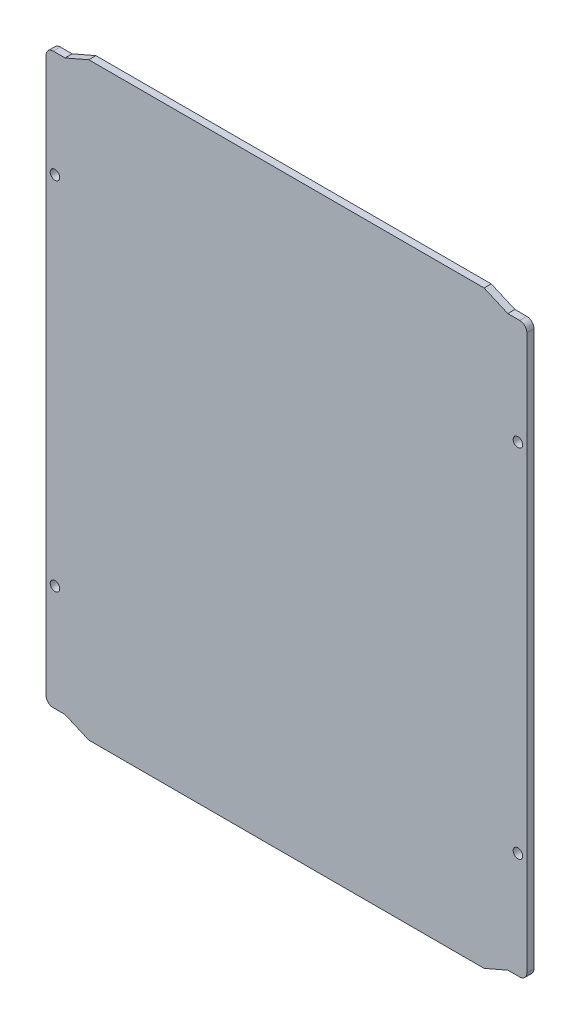
ISO-10303-21;
HEADER;
FILE_DESCRIPTION(('STEP AP214'),'2;1');
FILE_NAME('part.step','',(''),(''),'','','');
FILE_SCHEMA(('AUTOMOTIVE_DESIGN { 1 0 10303 214 1 1 1 1 }'));
ENDSEC;
DATA;
#1=APPLICATION_CONTEXT('core data for automotive mechanical design processes');
#2=APPLICATION_PROTOCOL_DEFINITION('international standard','automotive_design',2000,#1);
#3=PRODUCT_CONTEXT('',#1,'mechanical');
#4=PRODUCT('Part','Part','',(#3));
#5=PRODUCT_RELATED_PRODUCT_CATEGORY('part','',(#4));
#6=PRODUCT_DEFINITION_FORMATION('','',#4);
#7=PRODUCT_DEFINITION_CONTEXT('part definition',#1,'design');
#8=PRODUCT_DEFINITION('design','',#6,#7);
#9=PRODUCT_DEFINITION_SHAPE('','',#8);
#10=(LENGTH_UNIT() NAMED_UNIT(*) SI_UNIT(.MILLI.,.METRE.));
#11=(NAMED_UNIT(*) PLANE_ANGLE_UNIT() SI_UNIT($,.RADIAN.));
#12=(NAMED_UNIT(*) SI_UNIT($,.STERADIAN.) SOLID_ANGLE_UNIT());
#13=UNCERTAINTY_MEASURE_WITH_UNIT(LENGTH_MEASURE(1.E-05),#10,'distance_accuracy_value','');
#14=(GEOMETRIC_REPRESENTATION_CONTEXT(3) GLOBAL_UNCERTAINTY_ASSIGNED_CONTEXT((#13)) GLOBAL_UNIT_ASSIGNED_CONTEXT((#10,
#11,#12)) REPRESENTATION_CONTEXT('',''));
#15=CARTESIAN_POINT('',(0.,0.,0.));
#16=DIRECTION('',(0.,0.,1.));
#17=DIRECTION('',(1.,0.,0.));
#18=AXIS2_PLACEMENT_3D('',#15,#16,#17);
#19=CARTESIAN_POINT('',(3.,7.34000000000001,3.));
#20=DIRECTION('',(0.,0.,-1.));
#21=DIRECTION('',(-1.,0.,0.));
#22=AXIS2_PLACEMENT_3D('',#19,#20,#21);
#23=CYLINDRICAL_SURFACE('',#22,3.);
#24=CARTESIAN_POINT('',(3.,7.34000000000001,0.));
#25=DIRECTION('',(0.,0.,1.));
#26=DIRECTION('',(-1.,0.,0.));
#27=AXIS2_PLACEMENT_3D('',#24,#25,#26);
#28=CIRCLE('',#27,3.);
#29=CARTESIAN_POINT('',(0.,7.34000000000001,0.));
#30=VERTEX_POINT('',#29);
#31=CARTESIAN_POINT('',(3.,4.34000000000001,0.));
#32=VERTEX_POINT('',#31);
#33=EDGE_CURVE('E183',#30,#32,#28,.T.);
#34=ORIENTED_EDGE('',*,*,#33,.T.);
#35=DIRECTION('',(0.,0.,-1.));
#36=VECTOR('',#35,1.);
#37=CARTESIAN_POINT('',(3.,4.34000000000001,3.));
#38=LINE('',#37,#36);
#39=CARTESIAN_POINT('',(3.,4.34000000000001,3.));
#40=VERTEX_POINT('',#39);
#41=EDGE_CURVE('E12',#40,#32,#38,.T.);
#42=ORIENTED_EDGE('',*,*,#41,.F.);
#43=CARTESIAN_POINT('',(3.,7.34000000000001,3.));
#44=DIRECTION('',(0.,0.,1.));
#45=DIRECTION('',(-1.,0.,0.));
#46=AXIS2_PLACEMENT_3D('',#43,#44,#45);
#47=CIRCLE('',#46,3.);
#48=CARTESIAN_POINT('',(0.,7.34000000000001,3.));
#49=VERTEX_POINT('',#48);
#50=EDGE_CURVE('E201',#49,#40,#47,.T.);
#51=ORIENTED_EDGE('',*,*,#50,.F.);
#52=DIRECTION('',(0.,0.,-1.));
#53=VECTOR('',#52,1.);
#54=CARTESIAN_POINT('',(0.,7.34000000000001,3.));
#55=LINE('',#54,#53);
#56=EDGE_CURVE('E179',#49,#30,#55,.T.);
#57=ORIENTED_EDGE('',*,*,#56,.T.);
#58=EDGE_LOOP('',(#34,#42,#51,#57));
#59=FACE_BOUND('',#58,.T.);
#60=ADVANCED_FACE('F39',(#59),#23,.T.);
#61=CARTESIAN_POINT('',(8.,4.34000000000001,3.));
#62=DIRECTION('',(0.,1.,0.));
#63=DIRECTION('',(0.,0.,1.));
#64=AXIS2_PLACEMENT_3D('',#61,#62,#63);
#65=PLANE('',#64);
#66=DIRECTION('',(1.,0.,0.));
#67=VECTOR('',#66,1.);
#68=CARTESIAN_POINT('',(8.,4.34000000000001,0.));
#69=LINE('',#68,#67);
#70=CARTESIAN_POINT('',(8.,4.34000000000001,0.));
#71=VERTEX_POINT('',#70);
#72=EDGE_CURVE('E186',#32,#71,#69,.T.);
#73=ORIENTED_EDGE('',*,*,#72,.T.);
#74=DIRECTION('',(0.,0.,-1.));
#75=VECTOR('',#74,1.);
#76=CARTESIAN_POINT('',(8.,4.34000000000001,3.));
#77=LINE('',#76,#75);
#78=CARTESIAN_POINT('',(8.,4.34000000000001,3.));
#79=VERTEX_POINT('',#78);
#80=EDGE_CURVE('E47',#79,#71,#77,.T.);
#81=ORIENTED_EDGE('',*,*,#80,.F.);
#82=DIRECTION('',(1.,0.,0.));
#83=VECTOR('',#82,1.);
#84=CARTESIAN_POINT('',(8.,4.34000000000001,3.));
#85=LINE('',#84,#83);
#86=EDGE_CURVE('E122',#40,#79,#85,.T.);
#87=ORIENTED_EDGE('',*,*,#86,.F.);
#88=ORIENTED_EDGE('',*,*,#41,.T.);
#89=EDGE_LOOP('',(#73,#81,#87,#88));
#90=FACE_BOUND('',#89,.T.);
#91=ADVANCED_FACE('F316',(#90),#65,.F.);
#92=CARTESIAN_POINT('',(18.,0.,3.));
#93=DIRECTION('',(0.398122248208909,0.917332369144948,0.));
#94=DIRECTION('',(-0.917332369144949,0.398122248208909,0.));
#95=AXIS2_PLACEMENT_3D('',#92,#93,#94);
#96=PLANE('',#95);
#97=DIRECTION('',(0.917332369144949,-0.398122248208909,0.));
#98=VECTOR('',#97,1.);
#99=CARTESIAN_POINT('',(18.,0.,0.));
#100=LINE('',#99,#98);
#101=CARTESIAN_POINT('',(18.,0.,0.));
#102=VERTEX_POINT('',#101);
#103=EDGE_CURVE('E242',#71,#102,#100,.T.);
#104=ORIENTED_EDGE('',*,*,#103,.T.);
#105=DIRECTION('',(0.,0.,-1.));
#106=VECTOR('',#105,1.);
#107=CARTESIAN_POINT('',(18.,0.,3.));
#108=LINE('',#107,#106);
#109=CARTESIAN_POINT('',(18.,0.,3.));
#110=VERTEX_POINT('',#109);
#111=EDGE_CURVE('E234',#110,#102,#108,.T.);
#112=ORIENTED_EDGE('',*,*,#111,.F.);
#113=DIRECTION('',(0.917332369144949,-0.398122248208909,0.));
#114=VECTOR('',#113,1.);
#115=CARTESIAN_POINT('',(18.,0.,3.));
#116=LINE('',#115,#114);
#117=EDGE_CURVE('E243',#79,#110,#116,.T.);
#118=ORIENTED_EDGE('',*,*,#117,.F.);
#119=ORIENTED_EDGE('',*,*,#80,.T.);
#120=EDGE_LOOP('',(#104,#112,#118,#119));
#121=FACE_BOUND('',#120,.T.);
#122=ADVANCED_FACE('F240',(#121),#96,.F.);
#123=CARTESIAN_POINT('',(184.5,0.,3.));
#124=DIRECTION('',(0.,1.,0.));
#125=DIRECTION('',(-1.,0.,0.));
#126=AXIS2_PLACEMENT_3D('',#123,#124,#125);
#127=PLANE('',#126);
#128=DIRECTION('',(1.,0.,0.));
#129=VECTOR('',#128,1.);
#130=CARTESIAN_POINT('',(184.5,0.,0.));
#131=LINE('',#130,#129);
#132=CARTESIAN_POINT('',(184.5,0.,0.));
#133=VERTEX_POINT('',#132);
#134=EDGE_CURVE('E249',#102,#133,#131,.T.);
#135=ORIENTED_EDGE('',*,*,#134,.T.);
#136=DIRECTION('',(0.,0.,-1.));
#137=VECTOR('',#136,1.);
#138=CARTESIAN_POINT('',(184.5,0.,3.));
#139=LINE('',#138,#137);
#140=CARTESIAN_POINT('',(184.5,0.,3.));
#141=VERTEX_POINT('',#140);
#142=EDGE_CURVE('E231',#141,#133,#139,.T.);
#143=ORIENTED_EDGE('',*,*,#142,.F.);
#144=DIRECTION('',(1.,0.,0.));
#145=VECTOR('',#144,1.);
#146=CARTESIAN_POINT('',(184.5,0.,3.));
#147=LINE('',#146,#145);
#148=EDGE_CURVE('E584',#110,#141,#147,.T.);
#149=ORIENTED_EDGE('',*,*,#148,.F.);
#150=ORIENTED_EDGE('',*,*,#111,.T.);
#151=EDGE_LOOP('',(#135,#143,#149,#150));
#152=FACE_BOUND('',#151,.T.);
#153=ADVANCED_FACE('F323',(#152),#127,.F.);
#154=CARTESIAN_POINT('',(194.5,4.34000000000018,3.));
#155=DIRECTION('',(-0.398122248208922,0.917332369144943,0.));
#156=DIRECTION('',(-0.917332369144943,-0.398122248208922,0.));
#157=AXIS2_PLACEMENT_3D('',#154,#155,#156);
#158=PLANE('',#157);
#159=DIRECTION('',(0.917332369144943,0.398122248208922,0.));
#160=VECTOR('',#159,1.);
#161=CARTESIAN_POINT('',(194.5,4.34000000000018,0.));
#162=LINE('',#161,#160);
#163=CARTESIAN_POINT('',(194.5,4.34000000000018,0.));
#164=VERTEX_POINT('',#163);
#165=EDGE_CURVE('E250',#133,#164,#162,.T.);
#166=ORIENTED_EDGE('',*,*,#165,.T.);
#167=DIRECTION('',(0.,0.,-1.));
#168=VECTOR('',#167,1.);
#169=CARTESIAN_POINT('',(194.5,4.34000000000018,3.));
#170=LINE('',#169,#168);
#171=CARTESIAN_POINT('',(194.5,4.34000000000018,3.));
#172=VERTEX_POINT('',#171);
#173=EDGE_CURVE('E228',#172,#164,#170,.T.);
#174=ORIENTED_EDGE('',*,*,#173,.F.);
#175=DIRECTION('',(0.917332369144943,0.398122248208922,0.));
#176=VECTOR('',#175,1.);
#177=CARTESIAN_POINT('',(194.5,4.34000000000018,3.));
#178=LINE('',#177,#176);
#179=EDGE_CURVE('E586',#141,#172,#178,.T.);
#180=ORIENTED_EDGE('',*,*,#179,.F.);
#181=ORIENTED_EDGE('',*,*,#142,.T.);
#182=EDGE_LOOP('',(#166,#174,#180,#181));
#183=FACE_BOUND('',#182,.T.);
#184=ADVANCED_FACE('F328',(#183),#158,.F.);
#185=CARTESIAN_POINT('',(199.5,4.3400000000001,3.));
#186=DIRECTION('',(0.,1.,0.));
#187=DIRECTION('',(-1.,0.,0.));
#188=AXIS2_PLACEMENT_3D('',#185,#186,#187);
#189=PLANE('',#188);
#190=DIRECTION('',(1.,0.,0.));
#191=VECTOR('',#190,1.);
#192=CARTESIAN_POINT('',(199.5,4.3400000000001,0.));
#193=LINE('',#192,#191);
#194=CARTESIAN_POINT('',(199.5,4.3400000000001,0.));
#195=VERTEX_POINT('',#194);
#196=EDGE_CURVE('E261',#164,#195,#193,.T.);
#197=ORIENTED_EDGE('',*,*,#196,.T.);
#198=DIRECTION('',(0.,0.,-1.));
#199=VECTOR('',#198,1.);
#200=CARTESIAN_POINT('',(199.5,4.3400000000001,3.));
#201=LINE('',#200,#199);
#202=CARTESIAN_POINT('',(199.5,4.3400000000001,3.));
#203=VERTEX_POINT('',#202);
#204=EDGE_CURVE('E225',#203,#195,#201,.T.);
#205=ORIENTED_EDGE('',*,*,#204,.F.);
#206=DIRECTION('',(1.,0.,0.));
#207=VECTOR('',#206,1.);
#208=CARTESIAN_POINT('',(199.5,4.3400000000001,3.));
#209=LINE('',#208,#207);
#210=EDGE_CURVE('E588',#172,#203,#209,.T.);
#211=ORIENTED_EDGE('',*,*,#210,.F.);
#212=ORIENTED_EDGE('',*,*,#173,.T.);
#213=EDGE_LOOP('',(#197,#205,#211,#212));
#214=FACE_BOUND('',#213,.T.);
#215=ADVANCED_FACE('F332',(#214),#189,.F.);
#216=CARTESIAN_POINT('',(199.5,7.34000000000011,3.));
#217=DIRECTION('',(0.,0.,-1.));
#218=DIRECTION('',(-1.,0.,0.));
#219=AXIS2_PLACEMENT_3D('',#216,#217,#218);
#220=CYLINDRICAL_SURFACE('',#219,3.);
#221=CARTESIAN_POINT('',(199.5,7.34000000000011,0.));
#222=DIRECTION('',(0.,0.,1.));
#223=DIRECTION('',(-1.,0.,0.));
#224=AXIS2_PLACEMENT_3D('',#221,#222,#223);
#225=CIRCLE('',#224,3.);
#226=CARTESIAN_POINT('',(202.5,7.34000000000011,0.));
#227=VERTEX_POINT('',#226);
#228=EDGE_CURVE('E264',#195,#227,#225,.T.);
#229=ORIENTED_EDGE('',*,*,#228,.T.);
#230=DIRECTION('',(0.,0.,-1.));
#231=VECTOR('',#230,1.);
#232=CARTESIAN_POINT('',(202.5,7.34000000000011,3.));
#233=LINE('',#232,#231);
#234=CARTESIAN_POINT('',(202.5,7.34000000000011,3.));
#235=VERTEX_POINT('',#234);
#236=EDGE_CURVE('E222',#235,#227,#233,.T.);
#237=ORIENTED_EDGE('',*,*,#236,.F.);
#238=CARTESIAN_POINT('',(199.5,7.34000000000011,3.));
#239=DIRECTION('',(0.,0.,1.));
#240=DIRECTION('',(-1.,0.,0.));
#241=AXIS2_PLACEMENT_3D('',#238,#239,#240);
#242=CIRCLE('',#241,3.);
#243=EDGE_CURVE('E590',#203,#235,#242,.T.);
#244=ORIENTED_EDGE('',*,*,#243,.F.);
#245=ORIENTED_EDGE('',*,*,#204,.T.);
#246=EDGE_LOOP('',(#229,#237,#244,#245));
#247=FACE_BOUND('',#246,.T.);
#248=ADVANCED_FACE('F336',(#247),#220,.T.);
#249=CARTESIAN_POINT('',(202.5,240.840000000001,3.));
#250=DIRECTION('',(-1.,0.,0.));
#251=DIRECTION('',(0.,-1.,0.));
#252=AXIS2_PLACEMENT_3D('',#249,#250,#251);
#253=PLANE('',#252);
#254=DIRECTION('',(0.,1.,0.));
#255=VECTOR('',#254,1.);
#256=CARTESIAN_POINT('',(202.5,240.840000000001,0.));
#257=LINE('',#256,#255);
#258=CARTESIAN_POINT('',(202.5,240.840000000001,0.));
#259=VERTEX_POINT('',#258);
#260=EDGE_CURVE('E267',#227,#259,#257,.T.);
#261=ORIENTED_EDGE('',*,*,#260,.T.);
#262=DIRECTION('',(0.,0.,-1.));
#263=VECTOR('',#262,1.);
#264=CARTESIAN_POINT('',(202.5,240.840000000001,3.));
#265=LINE('',#264,#263);
#266=CARTESIAN_POINT('',(202.5,240.840000000001,3.));
#267=VERTEX_POINT('',#266);
#268=EDGE_CURVE('E219',#267,#259,#265,.T.);
#269=ORIENTED_EDGE('',*,*,#268,.F.);
#270=DIRECTION('',(0.,1.,0.));
#271=VECTOR('',#270,1.);
#272=CARTESIAN_POINT('',(202.5,240.840000000001,3.));
#273=LINE('',#272,#271);
#274=EDGE_CURVE('E592',#235,#267,#273,.T.);
#275=ORIENTED_EDGE('',*,*,#274,.F.);
#276=ORIENTED_EDGE('',*,*,#236,.T.);
#277=EDGE_LOOP('',(#261,#269,#275,#276));
#278=FACE_BOUND('',#277,.T.);
#279=ADVANCED_FACE('F340',(#278),#253,.F.);
#280=CARTESIAN_POINT('',(199.5,240.840000000001,3.));
#281=DIRECTION('',(0.,0.,-1.));
#282=DIRECTION('',(-1.,0.,0.));
#283=AXIS2_PLACEMENT_3D('',#280,#281,#282);
#284=CYLINDRICAL_SURFACE('',#283,3.);
#285=CARTESIAN_POINT('',(199.5,240.840000000001,0.));
#286=DIRECTION('',(0.,0.,1.));
#287=DIRECTION('',(-1.,0.,0.));
#288=AXIS2_PLACEMENT_3D('',#285,#286,#287);
#289=CIRCLE('',#288,3.);
#290=CARTESIAN_POINT('',(199.5,243.840000000001,0.));
#291=VERTEX_POINT('',#290);
#292=EDGE_CURVE('E275',#259,#291,#289,.T.);
#293=ORIENTED_EDGE('',*,*,#292,.T.);
#294=DIRECTION('',(0.,0.,-1.));
#295=VECTOR('',#294,1.);
#296=CARTESIAN_POINT('',(199.5,243.840000000001,3.));
#297=LINE('',#296,#295);
#298=CARTESIAN_POINT('',(199.5,243.840000000001,3.));
#299=VERTEX_POINT('',#298);
#300=EDGE_CURVE('E216',#299,#291,#297,.T.);
#301=ORIENTED_EDGE('',*,*,#300,.F.);
#302=CARTESIAN_POINT('',(199.5,240.840000000001,3.));
#303=DIRECTION('',(0.,0.,1.));
#304=DIRECTION('',(-1.,0.,0.));
#305=AXIS2_PLACEMENT_3D('',#302,#303,#304);
#306=CIRCLE('',#305,3.);
#307=EDGE_CURVE('E594',#267,#299,#306,.T.);
#308=ORIENTED_EDGE('',*,*,#307,.F.);
#309=ORIENTED_EDGE('',*,*,#268,.T.);
#310=EDGE_LOOP('',(#293,#301,#308,#309));
#311=FACE_BOUND('',#310,.T.);
#312=ADVANCED_FACE('F344',(#311),#284,.T.);
#313=CARTESIAN_POINT('',(194.5,243.84,3.));
#314=DIRECTION('',(0.,-1.,0.));
#315=DIRECTION('',(1.,0.,0.));
#316=AXIS2_PLACEMENT_3D('',#313,#314,#315);
#317=PLANE('',#316);
#318=DIRECTION('',(-1.,0.,0.));
#319=VECTOR('',#318,1.);
#320=CARTESIAN_POINT('',(194.5,243.84,0.));
#321=LINE('',#320,#319);
#322=CARTESIAN_POINT('',(194.5,243.84,0.));
#323=VERTEX_POINT('',#322);
#324=EDGE_CURVE('E277',#291,#323,#321,.T.);
#325=ORIENTED_EDGE('',*,*,#324,.T.);
#326=DIRECTION('',(0.,0.,-1.));
#327=VECTOR('',#326,1.);
#328=CARTESIAN_POINT('',(194.5,243.84,3.));
#329=LINE('',#328,#327);
#330=CARTESIAN_POINT('',(194.5,243.84,3.));
#331=VERTEX_POINT('',#330);
#332=EDGE_CURVE('E213',#331,#323,#329,.T.);
#333=ORIENTED_EDGE('',*,*,#332,.F.);
#334=DIRECTION('',(-1.,0.,0.));
#335=VECTOR('',#334,1.);
#336=CARTESIAN_POINT('',(194.5,243.84,3.));
#337=LINE('',#336,#335);
#338=EDGE_CURVE('E596',#299,#331,#337,.T.);
#339=ORIENTED_EDGE('',*,*,#338,.F.);
#340=ORIENTED_EDGE('',*,*,#300,.T.);
#341=EDGE_LOOP('',(#325,#333,#339,#340));
#342=FACE_BOUND('',#341,.T.);
#343=ADVANCED_FACE('F348',(#342),#317,.F.);
#344=CARTESIAN_POINT('',(184.5,248.18,3.));
#345=DIRECTION('',(-0.398122248208875,-0.917332369144963,0.));
#346=DIRECTION('',(0.917332369144963,-0.398122248208875,0.));
#347=AXIS2_PLACEMENT_3D('',#344,#345,#346);
#348=PLANE('',#347);
#349=DIRECTION('',(-0.917332369144963,0.398122248208875,0.));
#350=VECTOR('',#349,1.);
#351=CARTESIAN_POINT('',(184.5,248.18,0.));
#352=LINE('',#351,#350);
#353=CARTESIAN_POINT('',(184.5,248.18,0.));
#354=VERTEX_POINT('',#353);
#355=EDGE_CURVE('E280',#323,#354,#352,.T.);
#356=ORIENTED_EDGE('',*,*,#355,.T.);
#357=DIRECTION('',(0.,0.,-1.));
#358=VECTOR('',#357,1.);
#359=CARTESIAN_POINT('',(184.5,248.18,3.));
#360=LINE('',#359,#358);
#361=CARTESIAN_POINT('',(184.5,248.18,3.));
#362=VERTEX_POINT('',#361);
#363=EDGE_CURVE('E210',#362,#354,#360,.T.);
#364=ORIENTED_EDGE('',*,*,#363,.F.);
#365=DIRECTION('',(-0.917332369144963,0.398122248208875,0.));
#366=VECTOR('',#365,1.);
#367=CARTESIAN_POINT('',(184.5,248.18,3.));
#368=LINE('',#367,#366);
#369=EDGE_CURVE('E598',#331,#362,#368,.T.);
#370=ORIENTED_EDGE('',*,*,#369,.F.);
#371=ORIENTED_EDGE('',*,*,#332,.T.);
#372=EDGE_LOOP('',(#356,#364,#370,#371));
#373=FACE_BOUND('',#372,.T.);
#374=ADVANCED_FACE('F352',(#373),#348,.F.);
#375=CARTESIAN_POINT('',(18.,248.18,3.));
#376=DIRECTION('',(0.,-1.,0.));
#377=DIRECTION('',(1.,0.,0.));
#378=AXIS2_PLACEMENT_3D('',#375,#376,#377);
#379=PLANE('',#378);
#380=DIRECTION('',(-1.,0.,0.));
#381=VECTOR('',#380,1.);
#382=CARTESIAN_POINT('',(18.,248.18,0.));
#383=LINE('',#382,#381);
#384=CARTESIAN_POINT('',(18.,248.18,0.));
#385=VERTEX_POINT('',#384);
#386=EDGE_CURVE('E283',#354,#385,#383,.T.);
#387=ORIENTED_EDGE('',*,*,#386,.T.);
#388=DIRECTION('',(0.,0.,-1.));
#389=VECTOR('',#388,1.);
#390=CARTESIAN_POINT('',(18.,248.18,3.));
#391=LINE('',#390,#389);
#392=CARTESIAN_POINT('',(18.,248.18,3.));
#393=VERTEX_POINT('',#392);
#394=EDGE_CURVE('E207',#393,#385,#391,.T.);
#395=ORIENTED_EDGE('',*,*,#394,.F.);
#396=DIRECTION('',(-1.,0.,0.));
#397=VECTOR('',#396,1.);
#398=CARTESIAN_POINT('',(18.,248.18,3.));
#399=LINE('',#398,#397);
#400=EDGE_CURVE('E600',#362,#393,#399,.T.);
#401=ORIENTED_EDGE('',*,*,#400,.F.);
#402=ORIENTED_EDGE('',*,*,#363,.T.);
#403=EDGE_LOOP('',(#387,#395,#401,#402));
#404=FACE_BOUND('',#403,.T.);
#405=ADVANCED_FACE('F296',(#404),#379,.F.);
#406=CARTESIAN_POINT('',(7.99999999999995,243.84,3.));
#407=DIRECTION('',(0.398122248208906,-0.91733236914495,0.));
#408=DIRECTION('',(0.91733236914495,0.398122248208906,0.));
#409=AXIS2_PLACEMENT_3D('',#406,#407,#408);
#410=PLANE('',#409);
#411=DIRECTION('',(-0.917332369144949,-0.398122248208906,0.));
#412=VECTOR('',#411,1.);
#413=CARTESIAN_POINT('',(7.99999999999995,243.84,0.));
#414=LINE('',#413,#412);
#415=CARTESIAN_POINT('',(7.99999999999995,243.84,0.));
#416=VERTEX_POINT('',#415);
#417=EDGE_CURVE('E288',#385,#416,#414,.T.);
#418=ORIENTED_EDGE('',*,*,#417,.T.);
#419=DIRECTION('',(0.,0.,-1.));
#420=VECTOR('',#419,1.);
#421=CARTESIAN_POINT('',(7.99999999999995,243.84,3.));
#422=LINE('',#421,#420);
#423=CARTESIAN_POINT('',(7.99999999999995,243.84,3.));
#424=VERTEX_POINT('',#423);
#425=EDGE_CURVE('E174',#424,#416,#422,.T.);
#426=ORIENTED_EDGE('',*,*,#425,.F.);
#427=DIRECTION('',(-0.917332369144949,-0.398122248208906,0.));
#428=VECTOR('',#427,1.);
#429=CARTESIAN_POINT('',(7.99999999999995,243.84,3.));
#430=LINE('',#429,#428);
#431=EDGE_CURVE('E165',#393,#424,#430,.T.);
#432=ORIENTED_EDGE('',*,*,#431,.F.);
#433=ORIENTED_EDGE('',*,*,#394,.T.);
#434=EDGE_LOOP('',(#418,#426,#432,#433));
#435=FACE_BOUND('',#434,.T.);
#436=ADVANCED_FACE('F300',(#435),#410,.F.);
#437=CARTESIAN_POINT('',(2.99999999999996,243.84,3.));
#438=DIRECTION('',(0.,-1.,0.));
#439=DIRECTION('',(0.,0.,-1.));
#440=AXIS2_PLACEMENT_3D('',#437,#438,#439);
#441=PLANE('',#440);
#442=DIRECTION('',(-1.,0.,0.));
#443=VECTOR('',#442,1.);
#444=CARTESIAN_POINT('',(2.99999999999996,243.84,0.));
#445=LINE('',#444,#443);
#446=CARTESIAN_POINT('',(2.99999999999996,243.84,0.));
#447=VERTEX_POINT('',#446);
#448=EDGE_CURVE('E173',#416,#447,#445,.T.);
#449=ORIENTED_EDGE('',*,*,#448,.T.);
#450=DIRECTION('',(0.,0.,-1.));
#451=VECTOR('',#450,1.);
#452=CARTESIAN_POINT('',(2.99999999999996,243.84,3.));
#453=LINE('',#452,#451);
#454=CARTESIAN_POINT('',(2.99999999999996,243.84,3.));
#455=VERTEX_POINT('',#454);
#456=EDGE_CURVE('E170',#455,#447,#453,.T.);
#457=ORIENTED_EDGE('',*,*,#456,.F.);
#458=DIRECTION('',(-1.,0.,0.));
#459=VECTOR('',#458,1.);
#460=CARTESIAN_POINT('',(2.99999999999996,243.84,3.));
#461=LINE('',#460,#459);
#462=EDGE_CURVE('E159',#424,#455,#461,.T.);
#463=ORIENTED_EDGE('',*,*,#462,.F.);
#464=ORIENTED_EDGE('',*,*,#425,.T.);
#465=EDGE_LOOP('',(#449,#457,#463,#464));
#466=FACE_BOUND('',#465,.T.);
#467=ADVANCED_FACE('F171',(#466),#441,.F.);
#468=CARTESIAN_POINT('',(2.99999999999996,240.84,3.));
#469=DIRECTION('',(0.,0.,-1.));
#470=DIRECTION('',(-1.,0.,0.));
#471=AXIS2_PLACEMENT_3D('',#468,#469,#470);
#472=CYLINDRICAL_SURFACE('',#471,2.99999999999998);
#473=CARTESIAN_POINT('',(2.99999999999996,240.84,0.));
#474=DIRECTION('',(0.,0.,1.));
#475=DIRECTION('',(-1.,0.,0.));
#476=AXIS2_PLACEMENT_3D('',#473,#474,#475);
#477=CIRCLE('',#476,2.99999999999998);
#478=CARTESIAN_POINT('',(0.,240.84,0.));
#479=VERTEX_POINT('',#478);
#480=EDGE_CURVE('E108',#447,#479,#477,.T.);
#481=ORIENTED_EDGE('',*,*,#480,.T.);
#482=DIRECTION('',(0.,0.,-1.));
#483=VECTOR('',#482,1.);
#484=CARTESIAN_POINT('',(0.,240.84,3.));
#485=LINE('',#484,#483);
#486=CARTESIAN_POINT('',(0.,240.84,3.));
#487=VERTEX_POINT('',#486);
#488=EDGE_CURVE('E175',#487,#479,#485,.T.);
#489=ORIENTED_EDGE('',*,*,#488,.F.);
#490=CARTESIAN_POINT('',(2.99999999999996,240.84,3.));
#491=DIRECTION('',(0.,0.,1.));
#492=DIRECTION('',(-1.,0.,0.));
#493=AXIS2_PLACEMENT_3D('',#490,#491,#492);
#494=CIRCLE('',#493,2.99999999999998);
#495=EDGE_CURVE('E163',#455,#487,#494,.T.);
#496=ORIENTED_EDGE('',*,*,#495,.F.);
#497=ORIENTED_EDGE('',*,*,#456,.T.);
#498=EDGE_LOOP('',(#481,#489,#496,#497));
#499=FACE_BOUND('',#498,.T.);
#500=ADVANCED_FACE('F177',(#499),#472,.T.);
#501=CARTESIAN_POINT('',(0.,7.34000000000001,3.));
#502=DIRECTION('',(1.,0.,0.));
#503=DIRECTION('',(0.,1.,0.));
#504=AXIS2_PLACEMENT_3D('',#501,#502,#503);
#505=PLANE('',#504);
#506=DIRECTION('',(0.,-1.,0.));
#507=VECTOR('',#506,1.);
#508=CARTESIAN_POINT('',(0.,7.34000000000001,0.));
#509=LINE('',#508,#507);
#510=EDGE_CURVE('E114',#479,#30,#509,.T.);
#511=ORIENTED_EDGE('',*,*,#510,.T.);
#512=ORIENTED_EDGE('',*,*,#56,.F.);
#513=DIRECTION('',(0.,-1.,0.));
#514=VECTOR('',#513,1.);
#515=CARTESIAN_POINT('',(0.,7.34000000000001,3.));
#516=LINE('',#515,#514);
#517=EDGE_CURVE('E55',#487,#49,#516,.T.);
#518=ORIENTED_EDGE('',*,*,#517,.F.);
#519=ORIENTED_EDGE('',*,*,#488,.T.);
#520=EDGE_LOOP('',(#511,#512,#518,#519));
#521=FACE_BOUND('',#520,.T.);
#522=ADVANCED_FACE('F304',(#521),#505,.F.);
#523=CARTESIAN_POINT('',(3.,7.34000000000001,3.));
#524=DIRECTION('',(0.,0.,-1.));
#525=DIRECTION('',(-1.,0.,0.));
#526=AXIS2_PLACEMENT_3D('',#523,#524,#525);
#527=PLANE('',#526);
#528=CARTESIAN_POINT('',(3.75000000000002,199.09,3.));
#529=DIRECTION('',(0.,0.,1.));
#530=DIRECTION('',(1.,0.,0.));
#531=AXIS2_PLACEMENT_3D('',#528,#529,#530);
#532=CIRCLE('',#531,2.);
#533=CARTESIAN_POINT('',(5.75000000000002,199.09,3.));
#534=VERTEX_POINT('',#533);
#535=EDGE_CURVE('E556',#534,#534,#532,.T.);
#536=ORIENTED_EDGE('',*,*,#535,.F.);
#537=EDGE_LOOP('',(#536));
#538=FACE_BOUND('',#537,.T.);
#539=CARTESIAN_POINT('',(3.75000000000002,49.09,3.));
#540=DIRECTION('',(0.,0.,1.));
#541=DIRECTION('',(1.,0.,0.));
#542=AXIS2_PLACEMENT_3D('',#539,#540,#541);
#543=CIRCLE('',#542,2.);
#544=CARTESIAN_POINT('',(5.75000000000002,49.09,3.));
#545=VERTEX_POINT('',#544);
#546=EDGE_CURVE('E558',#545,#545,#543,.T.);
#547=ORIENTED_EDGE('',*,*,#546,.F.);
#548=EDGE_LOOP('',(#547));
#549=FACE_BOUND('',#548,.T.);
#550=CARTESIAN_POINT('',(198.75,49.09,3.));
#551=DIRECTION('',(0.,0.,1.));
#552=DIRECTION('',(1.,0.,0.));
#553=AXIS2_PLACEMENT_3D('',#550,#551,#552);
#554=CIRCLE('',#553,2.);
#555=CARTESIAN_POINT('',(200.75,49.09,3.));
#556=VERTEX_POINT('',#555);
#557=EDGE_CURVE('E570',#556,#556,#554,.T.);
#558=ORIENTED_EDGE('',*,*,#557,.F.);
#559=EDGE_LOOP('',(#558));
#560=FACE_BOUND('',#559,.T.);
#561=CARTESIAN_POINT('',(198.75,199.09,3.));
#562=DIRECTION('',(0.,0.,1.));
#563=DIRECTION('',(1.,0.,0.));
#564=AXIS2_PLACEMENT_3D('',#561,#562,#563);
#565=CIRCLE('',#564,2.);
#566=CARTESIAN_POINT('',(200.75,199.09,3.));
#567=VERTEX_POINT('',#566);
#568=EDGE_CURVE('E576',#567,#567,#565,.T.);
#569=ORIENTED_EDGE('',*,*,#568,.F.);
#570=EDGE_LOOP('',(#569));
#571=FACE_BOUND('',#570,.T.);
#572=ORIENTED_EDGE('',*,*,#50,.T.);
#573=ORIENTED_EDGE('',*,*,#86,.T.);
#574=ORIENTED_EDGE('',*,*,#117,.T.);
#575=ORIENTED_EDGE('',*,*,#148,.T.);
#576=ORIENTED_EDGE('',*,*,#179,.T.);
#577=ORIENTED_EDGE('',*,*,#210,.T.);
#578=ORIENTED_EDGE('',*,*,#243,.T.);
#579=ORIENTED_EDGE('',*,*,#274,.T.);
#580=ORIENTED_EDGE('',*,*,#307,.T.);
#581=ORIENTED_EDGE('',*,*,#338,.T.);
#582=ORIENTED_EDGE('',*,*,#369,.T.);
#583=ORIENTED_EDGE('',*,*,#400,.T.);
#584=ORIENTED_EDGE('',*,*,#431,.T.);
#585=ORIENTED_EDGE('',*,*,#462,.T.);
#586=ORIENTED_EDGE('',*,*,#495,.T.);
#587=ORIENTED_EDGE('',*,*,#517,.T.);
#588=EDGE_LOOP('',(#572,#573,#574,#575,#576,#577,#578,#579,#580,#581,#582,#583,#584,#585,#586,#587));
#589=FACE_BOUND('',#588,.T.);
#590=ADVANCED_FACE('F161',(#538,#549,#560,#571,#589),#527,.F.);
#591=CARTESIAN_POINT('',(3.,7.34000000000001,0.));
#592=DIRECTION('',(0.,0.,-1.));
#593=DIRECTION('',(-1.,0.,0.));
#594=AXIS2_PLACEMENT_3D('',#591,#592,#593);
#595=PLANE('',#594);
#596=CARTESIAN_POINT('',(3.75000000000002,199.09,0.));
#597=DIRECTION('',(0.,0.,1.));
#598=DIRECTION('',(1.,0.,0.));
#599=AXIS2_PLACEMENT_3D('',#596,#597,#598);
#600=CIRCLE('',#599,2.);
#601=CARTESIAN_POINT('',(5.75000000000002,199.09,0.));
#602=VERTEX_POINT('',#601);
#603=EDGE_CURVE('E553',#602,#602,#600,.T.);
#604=ORIENTED_EDGE('',*,*,#603,.T.);
#605=EDGE_LOOP('',(#604));
#606=FACE_BOUND('',#605,.T.);
#607=CARTESIAN_POINT('',(3.75000000000002,49.09,0.));
#608=DIRECTION('',(0.,0.,1.));
#609=DIRECTION('',(1.,0.,0.));
#610=AXIS2_PLACEMENT_3D('',#607,#608,#609);
#611=CIRCLE('',#610,2.);
#612=CARTESIAN_POINT('',(5.75000000000002,49.09,0.));
#613=VERTEX_POINT('',#612);
#614=EDGE_CURVE('E566',#613,#613,#611,.T.);
#615=ORIENTED_EDGE('',*,*,#614,.T.);
#616=EDGE_LOOP('',(#615));
#617=FACE_BOUND('',#616,.T.);
#618=CARTESIAN_POINT('',(198.75,49.09,0.));
#619=DIRECTION('',(0.,0.,1.));
#620=DIRECTION('',(1.,0.,0.));
#621=AXIS2_PLACEMENT_3D('',#618,#619,#620);
#622=CIRCLE('',#621,2.);
#623=CARTESIAN_POINT('',(200.75,49.09,0.));
#624=VERTEX_POINT('',#623);
#625=EDGE_CURVE('E572',#624,#624,#622,.T.);
#626=ORIENTED_EDGE('',*,*,#625,.T.);
#627=EDGE_LOOP('',(#626));
#628=FACE_BOUND('',#627,.T.);
#629=CARTESIAN_POINT('',(198.75,199.09,0.));
#630=DIRECTION('',(0.,0.,1.));
#631=DIRECTION('',(1.,0.,0.));
#632=AXIS2_PLACEMENT_3D('',#629,#630,#631);
#633=CIRCLE('',#632,2.);
#634=CARTESIAN_POINT('',(200.75,199.09,0.));
#635=VERTEX_POINT('',#634);
#636=EDGE_CURVE('E187',#635,#635,#633,.T.);
#637=ORIENTED_EDGE('',*,*,#636,.T.);
#638=EDGE_LOOP('',(#637));
#639=FACE_BOUND('',#638,.T.);
#640=ORIENTED_EDGE('',*,*,#33,.F.);
#641=ORIENTED_EDGE('',*,*,#510,.F.);
#642=ORIENTED_EDGE('',*,*,#480,.F.);
#643=ORIENTED_EDGE('',*,*,#448,.F.);
#644=ORIENTED_EDGE('',*,*,#417,.F.);
#645=ORIENTED_EDGE('',*,*,#386,.F.);
#646=ORIENTED_EDGE('',*,*,#355,.F.);
#647=ORIENTED_EDGE('',*,*,#324,.F.);
#648=ORIENTED_EDGE('',*,*,#292,.F.);
#649=ORIENTED_EDGE('',*,*,#260,.F.);
#650=ORIENTED_EDGE('',*,*,#228,.F.);
#651=ORIENTED_EDGE('',*,*,#196,.F.);
#652=ORIENTED_EDGE('',*,*,#165,.F.);
#653=ORIENTED_EDGE('',*,*,#134,.F.);
#654=ORIENTED_EDGE('',*,*,#103,.F.);
#655=ORIENTED_EDGE('',*,*,#72,.F.);
#656=EDGE_LOOP('',(#640,#641,#642,#643,#644,#645,#646,#647,#648,#649,#650,#651,#652,#653,#654,#655));
#657=FACE_BOUND('',#656,.T.);
#658=ADVANCED_FACE('F247',(#606,#617,#628,#639,#657),#595,.T.);
#659=CARTESIAN_POINT('',(198.75,199.09,3.));
#660=DIRECTION('',(0.,0.,1.));
#661=DIRECTION('',(1.,0.,0.));
#662=AXIS2_PLACEMENT_3D('',#659,#660,#661);
#663=CYLINDRICAL_SURFACE('',#662,2.);
#664=ORIENTED_EDGE('',*,*,#636,.F.);
#665=EDGE_LOOP('',(#664));
#666=FACE_BOUND('',#665,.T.);
#667=ORIENTED_EDGE('',*,*,#568,.T.);
#668=EDGE_LOOP('',(#667));
#669=FACE_BOUND('',#668,.T.);
#670=ADVANCED_FACE('F392',(#666,#669),#663,.F.);
#671=CARTESIAN_POINT('',(198.75,49.09,3.));
#672=DIRECTION('',(0.,0.,1.));
#673=DIRECTION('',(1.,0.,0.));
#674=AXIS2_PLACEMENT_3D('',#671,#672,#673);
#675=CYLINDRICAL_SURFACE('',#674,2.);
#676=ORIENTED_EDGE('',*,*,#625,.F.);
#677=EDGE_LOOP('',(#676));
#678=FACE_BOUND('',#677,.T.);
#679=ORIENTED_EDGE('',*,*,#557,.T.);
#680=EDGE_LOOP('',(#679));
#681=FACE_BOUND('',#680,.T.);
#682=ADVANCED_FACE('F402',(#678,#681),#675,.F.);
#683=CARTESIAN_POINT('',(3.75000000000002,49.09,3.));
#684=DIRECTION('',(0.,0.,1.));
#685=DIRECTION('',(1.,0.,0.));
#686=AXIS2_PLACEMENT_3D('',#683,#684,#685);
#687=CYLINDRICAL_SURFACE('',#686,2.);
#688=ORIENTED_EDGE('',*,*,#614,.F.);
#689=EDGE_LOOP('',(#688));
#690=FACE_BOUND('',#689,.T.);
#691=ORIENTED_EDGE('',*,*,#546,.T.);
#692=EDGE_LOOP('',(#691));
#693=FACE_BOUND('',#692,.T.);
#694=ADVANCED_FACE('F413',(#690,#693),#687,.F.);
#695=CARTESIAN_POINT('',(3.75000000000002,199.09,3.));
#696=DIRECTION('',(0.,0.,1.));
#697=DIRECTION('',(1.,0.,0.));
#698=AXIS2_PLACEMENT_3D('',#695,#696,#697);
#699=CYLINDRICAL_SURFACE('',#698,2.);
#700=ORIENTED_EDGE('',*,*,#603,.F.);
#701=EDGE_LOOP('',(#700));
#702=FACE_BOUND('',#701,.T.);
#703=ORIENTED_EDGE('',*,*,#535,.T.);
#704=EDGE_LOOP('',(#703));
#705=FACE_BOUND('',#704,.T.);
#706=ADVANCED_FACE('F424',(#702,#705),#699,.F.);
#707=CLOSED_SHELL('',(#60,#91,#122,#153,#184,#215,#248,#279,#312,#343,#374,#405,#436,#467,#500,
#522,#590,#658,#670,#682,#694,#706));
#708=MANIFOLD_SOLID_BREP('B2',#707);
#709=ADVANCED_BREP_SHAPE_REPRESENTATION('',(#18,#708),#14);
#710=SHAPE_DEFINITION_REPRESENTATION(#9,#709);
ENDSEC;
END-ISO-10303-21;
